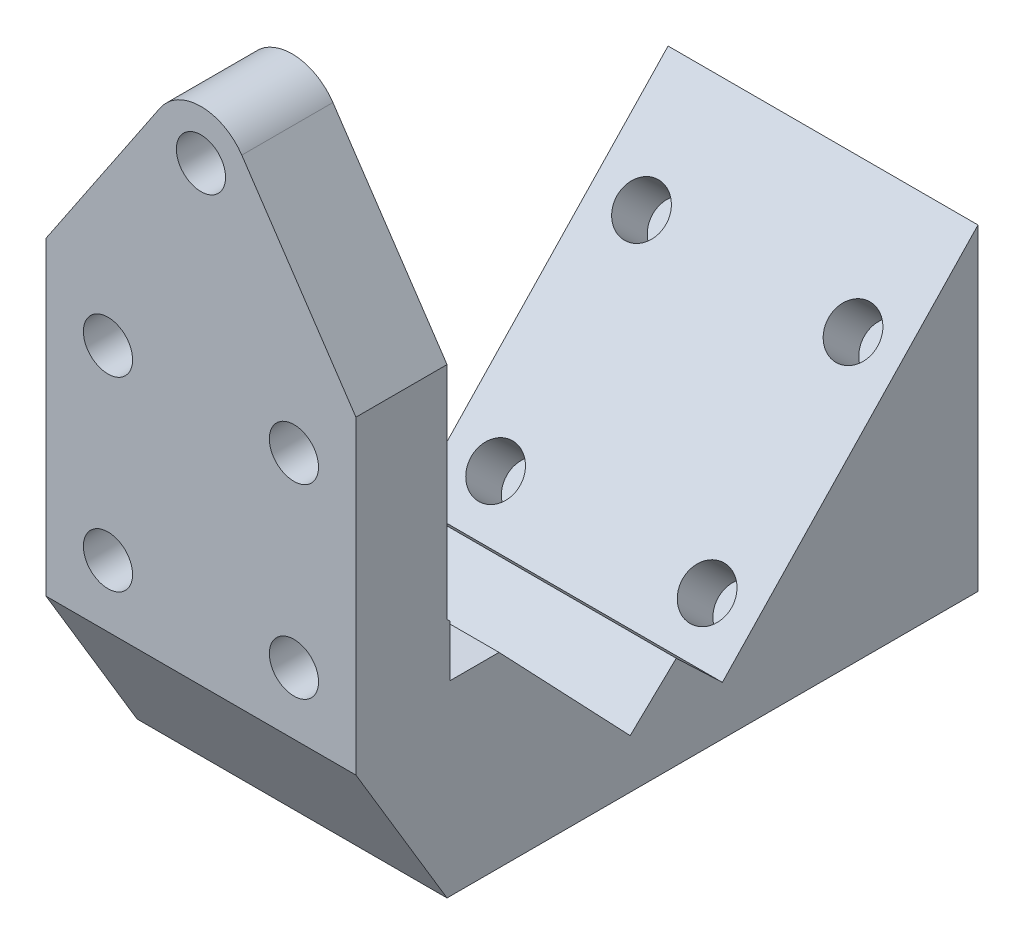
ISO-10303-21;
HEADER;
FILE_DESCRIPTION(('STEP AP214'),'2;1');
FILE_NAME('part.step','',(''),(''),'','','');
FILE_SCHEMA(('AUTOMOTIVE_DESIGN { 1 0 10303 214 1 1 1 1 }'));
ENDSEC;
DATA;
#1=APPLICATION_CONTEXT('core data for automotive mechanical design processes');
#2=APPLICATION_PROTOCOL_DEFINITION('international standard','automotive_design',2000,#1);
#3=PRODUCT_CONTEXT('',#1,'mechanical');
#4=PRODUCT('Part','Part','',(#3));
#5=PRODUCT_RELATED_PRODUCT_CATEGORY('part','',(#4));
#6=PRODUCT_DEFINITION_FORMATION('','',#4);
#7=PRODUCT_DEFINITION_CONTEXT('part definition',#1,'design');
#8=PRODUCT_DEFINITION('design','',#6,#7);
#9=PRODUCT_DEFINITION_SHAPE('','',#8);
#10=(LENGTH_UNIT() NAMED_UNIT(*) SI_UNIT(.MILLI.,.METRE.));
#11=(NAMED_UNIT(*) PLANE_ANGLE_UNIT() SI_UNIT($,.RADIAN.));
#12=(NAMED_UNIT(*) SI_UNIT($,.STERADIAN.) SOLID_ANGLE_UNIT());
#13=UNCERTAINTY_MEASURE_WITH_UNIT(LENGTH_MEASURE(1.E-05),#10,'distance_accuracy_value','');
#14=(GEOMETRIC_REPRESENTATION_CONTEXT(3) GLOBAL_UNCERTAINTY_ASSIGNED_CONTEXT((#13)) GLOBAL_UNIT_ASSIGNED_CONTEXT((#10,
#11,#12)) REPRESENTATION_CONTEXT('',''));
#15=CARTESIAN_POINT('',(0.,0.,0.));
#16=DIRECTION('',(0.,0.,1.));
#17=DIRECTION('',(1.,0.,0.));
#18=AXIS2_PLACEMENT_3D('',#15,#16,#17);
#19=CARTESIAN_POINT('',(-10.,-4.23768792161431,-5.87948086693109));
#20=DIRECTION('',(0.,0.689700373188135,-0.724094879987524));
#21=DIRECTION('',(0.,0.724094879987524,0.689700373188135));
#22=AXIS2_PLACEMENT_3D('',#19,#20,#21);
#23=PLANE('',#22);
#24=DIRECTION('',(1.,0.,0.));
#25=VECTOR('',#24,1.);
#26=CARTESIAN_POINT('',(-10.,-4.42669396080715,-6.05950911926227));
#27=LINE('',#26,#25);
#28=CARTESIAN_POINT('',(6.21181207954061,-4.42669396080715,-6.05950911926227));
#29=VERTEX_POINT('',#28);
#30=CARTESIAN_POINT('',(10.,-4.42669396080715,-6.05950911926227));
#31=VERTEX_POINT('',#30);
#32=EDGE_CURVE('E293',#29,#31,#27,.T.);
#33=ORIENTED_EDGE('',*,*,#32,.F.);
#34=CARTESIAN_POINT('',(6.,-6.,-7.5580831215935));
#35=DIRECTION('',(0.,0.689700373188135,-0.724094879987524));
#36=DIRECTION('',(0.,0.724094879987524,0.689700373188135));
#37=AXIS2_PLACEMENT_3D('',#34,#35,#36);
#38=ELLIPSE('',#37,2.19239224565067,1.5875);
#39=CARTESIAN_POINT('',(5.78818792045939,-4.42669396080715,-6.05950911926227));
#40=VERTEX_POINT('',#39);
#41=EDGE_CURVE('E48',#29,#40,#38,.F.);
#42=ORIENTED_EDGE('',*,*,#41,.T.);
#43=CARTESIAN_POINT('',(-5.7881879204594,-4.42669396080715,-6.05950911926227));
#44=VERTEX_POINT('',#43);
#45=EDGE_CURVE('E292',#44,#40,#27,.T.);
#46=ORIENTED_EDGE('',*,*,#45,.F.);
#47=CARTESIAN_POINT('',(-6.,-6.,-7.5580831215935));
#48=DIRECTION('',(0.,0.689700373188135,-0.724094879987524));
#49=DIRECTION('',(0.,0.724094879987524,0.689700373188135));
#50=AXIS2_PLACEMENT_3D('',#47,#48,#49);
#51=ELLIPSE('',#50,2.19239224565067,1.5875);
#52=CARTESIAN_POINT('',(-6.21181207954059,-4.42669396080715,-6.05950911926227));
#53=VERTEX_POINT('',#52);
#54=EDGE_CURVE('E54',#44,#53,#51,.F.);
#55=ORIENTED_EDGE('',*,*,#54,.T.);
#56=CARTESIAN_POINT('',(-10.,-4.42669396080715,-6.05950911926227));
#57=VERTEX_POINT('',#56);
#58=EDGE_CURVE('E289',#57,#53,#27,.T.);
#59=ORIENTED_EDGE('',*,*,#58,.F.);
#60=DIRECTION('',(0.,0.724094879987524,0.689700373188135));
#61=VECTOR('',#60,1.);
#62=CARTESIAN_POINT('',(-10.,-4.23768792161431,-5.87948086693109));
#63=LINE('',#62,#61);
#64=CARTESIAN_POINT('',(-10.,-4.23768792161431,-5.87948086693109));
#65=VERTEX_POINT('',#64);
#66=EDGE_CURVE('E242',#57,#65,#63,.T.);
#67=ORIENTED_EDGE('',*,*,#66,.T.);
#68=DIRECTION('',(1.,0.,0.));
#69=VECTOR('',#68,1.);
#70=CARTESIAN_POINT('',(-10.,-4.23768792161431,-5.87948086693109));
#71=LINE('',#70,#69);
#72=CARTESIAN_POINT('',(10.,-4.23768792161431,-5.87948086693109));
#73=VERTEX_POINT('',#72);
#74=EDGE_CURVE('E287',#65,#73,#71,.T.);
#75=ORIENTED_EDGE('',*,*,#74,.T.);
#76=DIRECTION('',(0.,0.724094879987524,0.689700373188135));
#77=VECTOR('',#76,1.);
#78=CARTESIAN_POINT('',(10.,-4.23768792161431,-5.87948086693109));
#79=LINE('',#78,#77);
#80=EDGE_CURVE('E281',#31,#73,#79,.T.);
#81=ORIENTED_EDGE('',*,*,#80,.F.);
#82=EDGE_LOOP('',(#33,#42,#46,#55,#59,#67,#75,#81));
#83=FACE_BOUND('',#82,.T.);
#84=ADVANCED_FACE('F33',(#83),#23,.T.);
#85=CARTESIAN_POINT('',(-10.,-10.,0.));
#86=DIRECTION('',(0.,0.,1.));
#87=DIRECTION('',(1.,0.,0.));
#88=AXIS2_PLACEMENT_3D('',#85,#86,#87);
#89=PLANE('',#88);
#90=CARTESIAN_POINT('',(6.,5.99999999999999,0.));
#91=DIRECTION('',(0.,0.,-1.));
#92=DIRECTION('',(-1.,0.,0.));
#93=AXIS2_PLACEMENT_3D('',#90,#91,#92);
#94=CIRCLE('',#93,1.5875);
#95=CARTESIAN_POINT('',(4.4125,5.99999999999999,0.));
#96=VERTEX_POINT('',#95);
#97=EDGE_CURVE('E198',#96,#96,#94,.T.);
#98=ORIENTED_EDGE('',*,*,#97,.T.);
#99=EDGE_LOOP('',(#98));
#100=FACE_BOUND('',#99,.T.);
#101=CARTESIAN_POINT('',(6.,-6.,0.));
#102=DIRECTION('',(0.,0.,-1.));
#103=DIRECTION('',(-1.,0.,0.));
#104=AXIS2_PLACEMENT_3D('',#101,#102,#103);
#105=CIRCLE('',#104,1.5875);
#106=CARTESIAN_POINT('',(4.4125,-6.,0.));
#107=VERTEX_POINT('',#106);
#108=EDGE_CURVE('E201',#107,#107,#105,.T.);
#109=ORIENTED_EDGE('',*,*,#108,.T.);
#110=EDGE_LOOP('',(#109));
#111=FACE_BOUND('',#110,.T.);
#112=CARTESIAN_POINT('',(-6.,-6.,0.));
#113=DIRECTION('',(0.,0.,-1.));
#114=DIRECTION('',(-1.,0.,0.));
#115=AXIS2_PLACEMENT_3D('',#112,#113,#114);
#116=CIRCLE('',#115,1.5875);
#117=CARTESIAN_POINT('',(-7.5875,-6.,0.));
#118=VERTEX_POINT('',#117);
#119=EDGE_CURVE('E181',#118,#118,#116,.T.);
#120=ORIENTED_EDGE('',*,*,#119,.T.);
#121=EDGE_LOOP('',(#120));
#122=FACE_BOUND('',#121,.T.);
#123=CARTESIAN_POINT('',(-6.,5.99999999999999,0.));
#124=DIRECTION('',(0.,0.,-1.));
#125=DIRECTION('',(-1.,0.,0.));
#126=AXIS2_PLACEMENT_3D('',#123,#124,#125);
#127=CIRCLE('',#126,1.5875);
#128=CARTESIAN_POINT('',(-7.5875,5.99999999999999,0.));
#129=VERTEX_POINT('',#128);
#130=EDGE_CURVE('E208',#129,#129,#127,.T.);
#131=ORIENTED_EDGE('',*,*,#130,.T.);
#132=EDGE_LOOP('',(#131));
#133=FACE_BOUND('',#132,.T.);
#134=DIRECTION('',(0.,-1.,0.));
#135=VECTOR('',#134,1.);
#136=CARTESIAN_POINT('',(10.,-10.,0.));
#137=LINE('',#136,#135);
#138=CARTESIAN_POINT('',(10.,10.,0.));
#139=VERTEX_POINT('',#138);
#140=CARTESIAN_POINT('',(10.,-10.,0.));
#141=VERTEX_POINT('',#140);
#142=EDGE_CURVE('E251',#139,#141,#137,.T.);
#143=ORIENTED_EDGE('',*,*,#142,.F.);
#144=DIRECTION('',(0.55760927190137,-0.830103547691265,0.));
#145=VECTOR('',#144,1.);
#146=CARTESIAN_POINT('',(2.63557876391976,20.9632900721285,0.));
#147=LINE('',#146,#145);
#148=CARTESIAN_POINT('',(2.63557876391977,20.9632900721285,0.));
#149=VERTEX_POINT('',#148);
#150=EDGE_CURVE('E191',#149,#139,#147,.T.);
#151=ORIENTED_EDGE('',*,*,#150,.F.);
#152=CARTESIAN_POINT('',(0.,19.1928806338417,0.));
#153=DIRECTION('',(0.,0.,1.));
#154=DIRECTION('',(1.,0.,0.));
#155=AXIS2_PLACEMENT_3D('',#152,#153,#154);
#156=CIRCLE('',#155,3.175);
#157=CARTESIAN_POINT('',(-2.63557876391977,20.9632900721285,0.));
#158=VERTEX_POINT('',#157);
#159=EDGE_CURVE('E159',#158,#149,#156,.F.);
#160=ORIENTED_EDGE('',*,*,#159,.F.);
#161=DIRECTION('',(0.55760927190137,0.830103547691265,0.));
#162=VECTOR('',#161,1.);
#163=CARTESIAN_POINT('',(-2.63557876391977,20.9632900721285,0.));
#164=LINE('',#163,#162);
#165=CARTESIAN_POINT('',(-10.,10.,0.));
#166=VERTEX_POINT('',#165);
#167=EDGE_CURVE('E162',#166,#158,#164,.T.);
#168=ORIENTED_EDGE('',*,*,#167,.F.);
#169=DIRECTION('',(0.,-1.,0.));
#170=VECTOR('',#169,1.);
#171=CARTESIAN_POINT('',(-10.,-10.,0.));
#172=LINE('',#171,#170);
#173=CARTESIAN_POINT('',(-10.,-10.,0.));
#174=VERTEX_POINT('',#173);
#175=EDGE_CURVE('E212',#166,#174,#172,.T.);
#176=ORIENTED_EDGE('',*,*,#175,.T.);
#177=DIRECTION('',(1.,0.,0.));
#178=VECTOR('',#177,1.);
#179=CARTESIAN_POINT('',(-10.,-10.,0.));
#180=LINE('',#179,#178);
#181=EDGE_CURVE('E250',#174,#141,#180,.T.);
#182=ORIENTED_EDGE('',*,*,#181,.T.);
#183=EDGE_LOOP('',(#143,#151,#160,#168,#176,#182));
#184=FACE_BOUND('',#183,.T.);
#185=CARTESIAN_POINT('',(0.,19.1928806338417,0.));
#186=DIRECTION('',(0.,0.,1.));
#187=DIRECTION('',(1.,0.,0.));
#188=AXIS2_PLACEMENT_3D('',#185,#186,#187);
#189=CIRCLE('',#188,1.5875);
#190=CARTESIAN_POINT('',(1.5875,19.1928806338417,0.));
#191=VERTEX_POINT('',#190);
#192=EDGE_CURVE('E178',#191,#191,#189,.F.);
#193=ORIENTED_EDGE('',*,*,#192,.T.);
#194=EDGE_LOOP('',(#193));
#195=FACE_BOUND('',#194,.T.);
#196=ADVANCED_FACE('F35',(#100,#111,#122,#133,#184,#195),#89,.T.);
#197=CARTESIAN_POINT('',(-10.,10.,-5.87948086693109));
#198=DIRECTION('',(0.,0.,-1.));
#199=DIRECTION('',(0.,1.,0.));
#200=AXIS2_PLACEMENT_3D('',#197,#198,#199);
#201=PLANE('',#200);
#202=CARTESIAN_POINT('',(6.,5.99999999999999,-5.87948086693109));
#203=DIRECTION('',(0.,0.,-1.));
#204=DIRECTION('',(0.,1.,0.));
#205=AXIS2_PLACEMENT_3D('',#202,#203,#204);
#206=CIRCLE('',#205,1.5875);
#207=CARTESIAN_POINT('',(6.,7.58749999999999,-5.87948086693109));
#208=VERTEX_POINT('',#207);
#209=EDGE_CURVE('E37',#208,#208,#206,.F.);
#210=ORIENTED_EDGE('',*,*,#209,.T.);
#211=EDGE_LOOP('',(#210));
#212=FACE_BOUND('',#211,.T.);
#213=CARTESIAN_POINT('',(-6.,5.99999999999999,-5.87948086693109));
#214=DIRECTION('',(0.,0.,-1.));
#215=DIRECTION('',(0.,1.,0.));
#216=AXIS2_PLACEMENT_3D('',#213,#214,#215);
#217=CIRCLE('',#216,1.5875);
#218=CARTESIAN_POINT('',(-6.,7.5875,-5.87948086693109));
#219=VERTEX_POINT('',#218);
#220=EDGE_CURVE('E211',#219,#219,#217,.F.);
#221=ORIENTED_EDGE('',*,*,#220,.T.);
#222=EDGE_LOOP('',(#221));
#223=FACE_BOUND('',#222,.T.);
#224=DIRECTION('',(0.,1.,0.));
#225=VECTOR('',#224,1.);
#226=CARTESIAN_POINT('',(10.,10.,-5.87948086693109));
#227=LINE('',#226,#225);
#228=CARTESIAN_POINT('',(10.,10.,-5.87948086693109));
#229=VERTEX_POINT('',#228);
#230=EDGE_CURVE('E284',#73,#229,#227,.T.);
#231=ORIENTED_EDGE('',*,*,#230,.F.);
#232=ORIENTED_EDGE('',*,*,#74,.F.);
#233=DIRECTION('',(0.,1.,0.));
#234=VECTOR('',#233,1.);
#235=CARTESIAN_POINT('',(-10.,10.,-5.87948086693109));
#236=LINE('',#235,#234);
#237=CARTESIAN_POINT('',(-10.,10.,-5.87948086693109));
#238=VERTEX_POINT('',#237);
#239=EDGE_CURVE('E245',#65,#238,#236,.T.);
#240=ORIENTED_EDGE('',*,*,#239,.T.);
#241=DIRECTION('',(0.55760927190137,0.830103547691265,0.));
#242=VECTOR('',#241,1.);
#243=CARTESIAN_POINT('',(-2.63557876391977,20.9632900721285,-5.87948086693109));
#244=LINE('',#243,#242);
#245=CARTESIAN_POINT('',(-2.63557876391977,20.9632900721285,-5.87948086693109));
#246=VERTEX_POINT('',#245);
#247=EDGE_CURVE('E171',#238,#246,#244,.T.);
#248=ORIENTED_EDGE('',*,*,#247,.T.);
#249=CARTESIAN_POINT('',(0.,19.1928806338417,-5.87948086693109));
#250=DIRECTION('',(0.,0.,-1.));
#251=DIRECTION('',(0.,1.,0.));
#252=AXIS2_PLACEMENT_3D('',#249,#250,#251);
#253=CIRCLE('',#252,3.175);
#254=CARTESIAN_POINT('',(2.63557876391977,20.9632900721285,-5.87948086693109));
#255=VERTEX_POINT('',#254);
#256=EDGE_CURVE('E158',#246,#255,#253,.T.);
#257=ORIENTED_EDGE('',*,*,#256,.T.);
#258=DIRECTION('',(0.55760927190137,-0.830103547691265,0.));
#259=VECTOR('',#258,1.);
#260=CARTESIAN_POINT('',(2.63557876391977,20.9632900721285,-5.87948086693109));
#261=LINE('',#260,#259);
#262=EDGE_CURVE('E166',#255,#229,#261,.T.);
#263=ORIENTED_EDGE('',*,*,#262,.T.);
#264=EDGE_LOOP('',(#231,#232,#240,#248,#257,#263));
#265=FACE_BOUND('',#264,.T.);
#266=CARTESIAN_POINT('',(0.,19.1928806338417,-5.87948086693109));
#267=DIRECTION('',(0.,0.,-1.));
#268=DIRECTION('',(0.,1.,0.));
#269=AXIS2_PLACEMENT_3D('',#266,#267,#268);
#270=CIRCLE('',#269,1.5875);
#271=CARTESIAN_POINT('',(0.,20.7803806338417,-5.87948086693109));
#272=VERTEX_POINT('',#271);
#273=EDGE_CURVE('E172',#272,#272,#270,.T.);
#274=ORIENTED_EDGE('',*,*,#273,.F.);
#275=EDGE_LOOP('',(#274));
#276=FACE_BOUND('',#275,.T.);
#277=ADVANCED_FACE('F175',(#212,#223,#265,#276),#201,.T.);
#278=CARTESIAN_POINT('',(-10.,-4.42669396080715,-6.05950911926227));
#279=DIRECTION('',(0.,0.,-1.));
#280=DIRECTION('',(-1.,0.,0.));
#281=AXIS2_PLACEMENT_3D('',#278,#279,#280);
#282=PLANE('',#281);
#283=ORIENTED_EDGE('',*,*,#45,.T.);
#284=CARTESIAN_POINT('',(6.,-6.,-6.05950911926227));
#285=DIRECTION('',(0.,0.,-1.));
#286=DIRECTION('',(-1.,0.,0.));
#287=AXIS2_PLACEMENT_3D('',#284,#285,#286);
#288=CIRCLE('',#287,1.5875);
#289=EDGE_CURVE('E11',#40,#29,#288,.F.);
#290=ORIENTED_EDGE('',*,*,#289,.T.);
#291=ORIENTED_EDGE('',*,*,#32,.T.);
#292=DIRECTION('',(0.,1.,0.));
#293=VECTOR('',#292,1.);
#294=CARTESIAN_POINT('',(10.,-4.42669396080715,-6.05950911926227));
#295=LINE('',#294,#293);
#296=CARTESIAN_POINT('',(10.,-7.76231207838568,-6.05950911926227));
#297=VERTEX_POINT('',#296);
#298=EDGE_CURVE('E278',#297,#31,#295,.T.);
#299=ORIENTED_EDGE('',*,*,#298,.F.);
#300=DIRECTION('',(1.,0.,0.));
#301=VECTOR('',#300,1.);
#302=CARTESIAN_POINT('',(-10.,-7.76231207838568,-6.05950911926227));
#303=LINE('',#302,#301);
#304=CARTESIAN_POINT('',(-10.,-7.76231207838568,-6.05950911926227));
#305=VERTEX_POINT('',#304);
#306=EDGE_CURVE('E294',#305,#297,#303,.T.);
#307=ORIENTED_EDGE('',*,*,#306,.F.);
#308=DIRECTION('',(0.,1.,0.));
#309=VECTOR('',#308,1.);
#310=CARTESIAN_POINT('',(-10.,-4.42669396080715,-6.05950911926227));
#311=LINE('',#310,#309);
#312=EDGE_CURVE('E239',#305,#57,#311,.T.);
#313=ORIENTED_EDGE('',*,*,#312,.T.);
#314=ORIENTED_EDGE('',*,*,#58,.T.);
#315=CARTESIAN_POINT('',(-6.,-6.,-6.05950911926227));
#316=DIRECTION('',(0.,0.,-1.));
#317=DIRECTION('',(-1.,0.,0.));
#318=AXIS2_PLACEMENT_3D('',#315,#316,#317);
#319=CIRCLE('',#318,1.5875);
#320=EDGE_CURVE('E42',#53,#44,#319,.F.);
#321=ORIENTED_EDGE('',*,*,#320,.T.);
#322=EDGE_LOOP('',(#283,#290,#291,#299,#307,#313,#314,#321));
#323=FACE_BOUND('',#322,.T.);
#324=ADVANCED_FACE('F316',(#323),#282,.T.);
#325=CARTESIAN_POINT('',(-10.,-7.76231207838568,-6.05950911926227));
#326=DIRECTION('',(0.,1.,0.));
#327=DIRECTION('',(0.,0.,1.));
#328=AXIS2_PLACEMENT_3D('',#325,#326,#327);
#329=PLANE('',#328);
#330=DIRECTION('',(0.,0.,1.));
#331=VECTOR('',#330,1.);
#332=CARTESIAN_POINT('',(10.,-7.76231207838568,-6.05950911926227));
#333=LINE('',#332,#331);
#334=CARTESIAN_POINT('',(10.,-7.76231207838568,-9.23668537625581));
#335=VERTEX_POINT('',#334);
#336=EDGE_CURVE('E275',#335,#297,#333,.T.);
#337=ORIENTED_EDGE('',*,*,#336,.F.);
#338=DIRECTION('',(1.,0.,0.));
#339=VECTOR('',#338,1.);
#340=CARTESIAN_POINT('',(-10.,-7.76231207838568,-9.23668537625581));
#341=LINE('',#340,#339);
#342=CARTESIAN_POINT('',(-10.,-7.76231207838568,-9.23668537625581));
#343=VERTEX_POINT('',#342);
#344=EDGE_CURVE('E296',#343,#335,#341,.T.);
#345=ORIENTED_EDGE('',*,*,#344,.F.);
#346=DIRECTION('',(0.,0.,1.));
#347=VECTOR('',#346,1.);
#348=CARTESIAN_POINT('',(-10.,-7.76231207838568,-6.05950911926227));
#349=LINE('',#348,#347);
#350=EDGE_CURVE('E236',#343,#305,#349,.T.);
#351=ORIENTED_EDGE('',*,*,#350,.T.);
#352=ORIENTED_EDGE('',*,*,#306,.T.);
#353=EDGE_LOOP('',(#337,#345,#351,#352));
#354=FACE_BOUND('',#353,.T.);
#355=ADVANCED_FACE('F326',(#354),#329,.T.);
#356=CARTESIAN_POINT('',(-10.,-7.76231207838568,-9.23668537625581));
#357=DIRECTION('',(0.,0.689700373188126,-0.724094879987533));
#358=DIRECTION('',(0.,0.724094879987533,0.689700373188126));
#359=AXIS2_PLACEMENT_3D('',#356,#357,#358);
#360=PLANE('',#359);
#361=DIRECTION('',(0.,0.724094879987533,0.689700373188126));
#362=VECTOR('',#361,1.);
#363=CARTESIAN_POINT('',(10.,-7.76231207838568,-9.23668537625581));
#364=LINE('',#363,#362);
#365=CARTESIAN_POINT('',(10.,-16.6450133882954,-17.6974583739448));
#366=VERTEX_POINT('',#365);
#367=EDGE_CURVE('E272',#366,#335,#364,.T.);
#368=ORIENTED_EDGE('',*,*,#367,.F.);
#369=DIRECTION('',(1.,0.,0.));
#370=VECTOR('',#369,1.);
#371=CARTESIAN_POINT('',(-10.,-16.6450133882954,-17.6974583739448));
#372=LINE('',#371,#370);
#373=CARTESIAN_POINT('',(-10.,-16.6450133882954,-17.6974583739448));
#374=VERTEX_POINT('',#373);
#375=EDGE_CURVE('E298',#374,#366,#372,.T.);
#376=ORIENTED_EDGE('',*,*,#375,.F.);
#377=DIRECTION('',(0.,0.724094879987533,0.689700373188126));
#378=VECTOR('',#377,1.);
#379=CARTESIAN_POINT('',(-10.,-7.76231207838568,-9.23668537625581));
#380=LINE('',#379,#378);
#381=EDGE_CURVE('E233',#374,#343,#380,.T.);
#382=ORIENTED_EDGE('',*,*,#381,.T.);
#383=ORIENTED_EDGE('',*,*,#344,.T.);
#384=EDGE_LOOP('',(#368,#376,#382,#383));
#385=FACE_BOUND('',#384,.T.);
#386=ADVANCED_FACE('F364',(#385),#360,.T.);
#387=CARTESIAN_POINT('',(-10.,-16.6450133882954,-17.6974583739448));
#388=DIRECTION('',(0.,0.724094879987534,0.689700373188125));
#389=DIRECTION('',(0.,-0.689700373188125,0.724094879987534));
#390=AXIS2_PLACEMENT_3D('',#387,#388,#389);
#391=PLANE('',#390);
#392=DIRECTION('',(0.,-0.689700373188125,0.724094879987534));
#393=VECTOR('',#392,1.);
#394=CARTESIAN_POINT('',(10.,-16.6450133882954,-17.6974583739448));
#395=LINE('',#394,#393);
#396=CARTESIAN_POINT('',(10.,-13.8103448544922,-20.6734883306936));
#397=VERTEX_POINT('',#396);
#398=EDGE_CURVE('E269',#397,#366,#395,.T.);
#399=ORIENTED_EDGE('',*,*,#398,.F.);
#400=DIRECTION('',(1.,0.,0.));
#401=VECTOR('',#400,1.);
#402=CARTESIAN_POINT('',(-10.,-13.8103448544922,-20.6734883306936));
#403=LINE('',#402,#401);
#404=CARTESIAN_POINT('',(-10.,-13.8103448544922,-20.6734883306936));
#405=VERTEX_POINT('',#404);
#406=EDGE_CURVE('E300',#405,#397,#403,.T.);
#407=ORIENTED_EDGE('',*,*,#406,.F.);
#408=DIRECTION('',(0.,-0.689700373188125,0.724094879987534));
#409=VECTOR('',#408,1.);
#410=CARTESIAN_POINT('',(-10.,-16.6450133882954,-17.6974583739448));
#411=LINE('',#410,#409);
#412=EDGE_CURVE('E230',#405,#374,#411,.T.);
#413=ORIENTED_EDGE('',*,*,#412,.T.);
#414=ORIENTED_EDGE('',*,*,#375,.T.);
#415=EDGE_LOOP('',(#399,#407,#413,#414));
#416=FACE_BOUND('',#415,.T.);
#417=ADVANCED_FACE('F362',(#416),#391,.T.);
#418=CARTESIAN_POINT('',(-10.,-13.8103448544922,-20.6734883306936));
#419=DIRECTION('',(0.,0.724094879987534,-0.689700373188125));
#420=DIRECTION('',(0.,0.689700373188125,0.724094879987534));
#421=AXIS2_PLACEMENT_3D('',#418,#419,#420);
#422=PLANE('',#421);
#423=DIRECTION('',(0.,0.689700373188125,0.724094879987534));
#424=VECTOR('',#423,1.);
#425=CARTESIAN_POINT('',(10.,-13.8103448544922,-20.6734883306936));
#426=LINE('',#425,#424);
#427=CARTESIAN_POINT('',(10.,-16.6450133882954,-23.6495182874424));
#428=VERTEX_POINT('',#427);
#429=EDGE_CURVE('E266',#428,#397,#426,.T.);
#430=ORIENTED_EDGE('',*,*,#429,.F.);
#431=DIRECTION('',(1.,0.,0.));
#432=VECTOR('',#431,1.);
#433=CARTESIAN_POINT('',(-10.,-16.6450133882954,-23.6495182874424));
#434=LINE('',#433,#432);
#435=CARTESIAN_POINT('',(-10.,-16.6450133882954,-23.6495182874424));
#436=VERTEX_POINT('',#435);
#437=EDGE_CURVE('E302',#436,#428,#434,.T.);
#438=ORIENTED_EDGE('',*,*,#437,.F.);
#439=DIRECTION('',(0.,0.689700373188125,0.724094879987534));
#440=VECTOR('',#439,1.);
#441=CARTESIAN_POINT('',(-10.,-13.8103448544922,-20.6734883306936));
#442=LINE('',#441,#440);
#443=EDGE_CURVE('E227',#436,#405,#442,.T.);
#444=ORIENTED_EDGE('',*,*,#443,.T.);
#445=ORIENTED_EDGE('',*,*,#406,.T.);
#446=EDGE_LOOP('',(#430,#438,#444,#445));
#447=FACE_BOUND('',#446,.T.);
#448=ADVANCED_FACE('F358',(#447),#422,.T.);
#449=CARTESIAN_POINT('',(-10.,-16.6450133882954,-23.6495182874424));
#450=DIRECTION('',(0.,0.689700373188125,0.724094879987534));
#451=DIRECTION('',(0.,-0.724094879987534,0.689700373188125));
#452=AXIS2_PLACEMENT_3D('',#449,#450,#451);
#453=PLANE('',#452);
#454=CARTESIAN_POINT('',(6.82499999999999,-14.346012144335,-25.8393169723147));
#455=DIRECTION('',(0.,0.689700373188125,0.724094879987534));
#456=DIRECTION('',(0.,-0.724094879987534,0.689700373188125));
#457=AXIS2_PLACEMENT_3D('',#454,#455,#456);
#458=CIRCLE('',#457,1.5875);
#459=CARTESIAN_POINT('',(6.82499999999999,-15.4955127663152,-24.7444176298785));
#460=VERTEX_POINT('',#459);
#461=EDGE_CURVE('E542',#460,#460,#458,.T.);
#462=ORIENTED_EDGE('',*,*,#461,.F.);
#463=EDGE_LOOP('',(#462));
#464=FACE_BOUND('',#463,.T.);
#465=CARTESIAN_POINT('',(-6.825,-14.346012144335,-25.8393169723147));
#466=DIRECTION('',(0.,0.689700373188125,0.724094879987534));
#467=DIRECTION('',(0.,-0.724094879987534,0.689700373188125));
#468=AXIS2_PLACEMENT_3D('',#465,#466,#467);
#469=CIRCLE('',#468,1.5875);
#470=CARTESIAN_POINT('',(-6.825,-15.4955127663152,-24.7444176298785));
#471=VERTEX_POINT('',#470);
#472=EDGE_CURVE('E551',#471,#471,#469,.T.);
#473=ORIENTED_EDGE('',*,*,#472,.F.);
#474=EDGE_LOOP('',(#473));
#475=FACE_BOUND('',#474,.T.);
#476=CARTESIAN_POINT('',(-6.82499999999999,-4.46211703250518,-35.2537270663326));
#477=DIRECTION('',(0.,0.689700373188125,0.724094879987534));
#478=DIRECTION('',(0.,-0.724094879987534,0.689700373188125));
#479=AXIS2_PLACEMENT_3D('',#476,#477,#478);
#480=CIRCLE('',#479,1.5875);
#481=CARTESIAN_POINT('',(-6.82499999999999,-5.61161765448539,-34.1588277238964));
#482=VERTEX_POINT('',#481);
#483=EDGE_CURVE('E557',#482,#482,#480,.T.);
#484=ORIENTED_EDGE('',*,*,#483,.F.);
#485=EDGE_LOOP('',(#484));
#486=FACE_BOUND('',#485,.T.);
#487=CARTESIAN_POINT('',(6.82499999999999,-4.46211703250518,-35.2537270663326));
#488=DIRECTION('',(0.,0.689700373188125,0.724094879987534));
#489=DIRECTION('',(0.,-0.724094879987534,0.689700373188125));
#490=AXIS2_PLACEMENT_3D('',#487,#488,#489);
#491=CIRCLE('',#490,1.58749999999999);
#492=CARTESIAN_POINT('',(6.82499999999999,-5.61161765448538,-34.1588277238964));
#493=VERTEX_POINT('',#492);
#494=EDGE_CURVE('E185',#493,#493,#491,.T.);
#495=ORIENTED_EDGE('',*,*,#494,.F.);
#496=EDGE_LOOP('',(#495));
#497=FACE_BOUND('',#496,.T.);
#498=DIRECTION('',(0.,-0.724094879987534,0.689700373188125));
#499=VECTOR('',#498,1.);
#500=CARTESIAN_POINT('',(10.,-16.6450133882954,-23.6495182874424));
#501=LINE('',#500,#499);
#502=CARTESIAN_POINT('',(10.,0.671552745258447,-40.1435475296524));
#503=VERTEX_POINT('',#502);
#504=EDGE_CURVE('E263',#503,#428,#501,.T.);
#505=ORIENTED_EDGE('',*,*,#504,.F.);
#506=DIRECTION('',(1.,0.,0.));
#507=VECTOR('',#506,1.);
#508=CARTESIAN_POINT('',(-10.,0.671552745258447,-40.1435475296524));
#509=LINE('',#508,#507);
#510=CARTESIAN_POINT('',(-10.,0.671552745258447,-40.1435475296524));
#511=VERTEX_POINT('',#510);
#512=EDGE_CURVE('E304',#511,#503,#509,.T.);
#513=ORIENTED_EDGE('',*,*,#512,.F.);
#514=DIRECTION('',(0.,-0.724094879987534,0.689700373188125));
#515=VECTOR('',#514,1.);
#516=CARTESIAN_POINT('',(-10.,-16.6450133882954,-23.6495182874424));
#517=LINE('',#516,#515);
#518=EDGE_CURVE('E224',#511,#436,#517,.T.);
#519=ORIENTED_EDGE('',*,*,#518,.T.);
#520=ORIENTED_EDGE('',*,*,#437,.T.);
#521=EDGE_LOOP('',(#505,#513,#519,#520));
#522=FACE_BOUND('',#521,.T.);
#523=ADVANCED_FACE('F354',(#464,#475,#486,#497,#522),#453,.T.);
#524=CARTESIAN_POINT('',(-10.,0.671552745258447,-40.1435475296524));
#525=DIRECTION('',(0.,0.,-1.));
#526=DIRECTION('',(-1.,0.,0.));
#527=AXIS2_PLACEMENT_3D('',#524,#525,#526);
#528=PLANE('',#527);
#529=DIRECTION('',(0.,1.,0.));
#530=VECTOR('',#529,1.);
#531=CARTESIAN_POINT('',(10.,0.671552745258447,-40.1435475296524));
#532=LINE('',#531,#530);
#533=CARTESIAN_POINT('',(10.,-19.8103448544922,-40.1435475296524));
#534=VERTEX_POINT('',#533);
#535=EDGE_CURVE('E260',#534,#503,#532,.T.);
#536=ORIENTED_EDGE('',*,*,#535,.F.);
#537=DIRECTION('',(1.,0.,0.));
#538=VECTOR('',#537,1.);
#539=CARTESIAN_POINT('',(-10.,-19.8103448544922,-40.1435475296524));
#540=LINE('',#539,#538);
#541=CARTESIAN_POINT('',(-10.,-19.8103448544922,-40.1435475296524));
#542=VERTEX_POINT('',#541);
#543=EDGE_CURVE('E306',#542,#534,#540,.T.);
#544=ORIENTED_EDGE('',*,*,#543,.F.);
#545=DIRECTION('',(0.,1.,0.));
#546=VECTOR('',#545,1.);
#547=CARTESIAN_POINT('',(-10.,0.671552745258447,-40.1435475296524));
#548=LINE('',#547,#546);
#549=EDGE_CURVE('E221',#542,#511,#548,.T.);
#550=ORIENTED_EDGE('',*,*,#549,.T.);
#551=ORIENTED_EDGE('',*,*,#512,.T.);
#552=EDGE_LOOP('',(#536,#544,#550,#551));
#553=FACE_BOUND('',#552,.T.);
#554=ADVANCED_FACE('F350',(#553),#528,.T.);
#555=CARTESIAN_POINT('',(-10.,-19.8103448544922,-40.1435475296524));
#556=DIRECTION('',(0.,-1.,0.));
#557=DIRECTION('',(0.,0.,-1.));
#558=AXIS2_PLACEMENT_3D('',#555,#556,#557);
#559=PLANE('',#558);
#560=DIRECTION('',(0.,0.,-1.));
#561=VECTOR('',#560,1.);
#562=CARTESIAN_POINT('',(10.,-19.8103448544922,-40.1435475296524));
#563=LINE('',#562,#561);
#564=CARTESIAN_POINT('',(10.,-19.8103448544922,-5.87948086693109));
#565=VERTEX_POINT('',#564);
#566=EDGE_CURVE('E257',#565,#534,#563,.T.);
#567=ORIENTED_EDGE('',*,*,#566,.F.);
#568=DIRECTION('',(1.,0.,0.));
#569=VECTOR('',#568,1.);
#570=CARTESIAN_POINT('',(-10.,-19.8103448544922,-5.87948086693109));
#571=LINE('',#570,#569);
#572=CARTESIAN_POINT('',(-10.,-19.8103448544922,-5.87948086693109));
#573=VERTEX_POINT('',#572);
#574=EDGE_CURVE('E308',#573,#565,#571,.T.);
#575=ORIENTED_EDGE('',*,*,#574,.F.);
#576=DIRECTION('',(0.,0.,-1.));
#577=VECTOR('',#576,1.);
#578=CARTESIAN_POINT('',(-10.,-19.8103448544922,-40.1435475296524));
#579=LINE('',#578,#577);
#580=EDGE_CURVE('E218',#573,#542,#579,.T.);
#581=ORIENTED_EDGE('',*,*,#580,.T.);
#582=ORIENTED_EDGE('',*,*,#543,.T.);
#583=EDGE_LOOP('',(#567,#575,#581,#582));
#584=FACE_BOUND('',#583,.T.);
#585=ADVANCED_FACE('F346',(#584),#559,.T.);
#586=CARTESIAN_POINT('',(-10.,-19.8103448544922,-5.87948086693109));
#587=DIRECTION('',(0.,-0.514063277243234,0.857752264345566));
#588=DIRECTION('',(0.,-0.857752264345566,-0.514063277243234));
#589=AXIS2_PLACEMENT_3D('',#586,#587,#588);
#590=PLANE('',#589);
#591=DIRECTION('',(0.,-0.857752264345566,-0.514063277243234));
#592=VECTOR('',#591,1.);
#593=CARTESIAN_POINT('',(10.,-19.8103448544922,-5.87948086693109));
#594=LINE('',#593,#592);
#595=EDGE_CURVE('E254',#141,#565,#594,.T.);
#596=ORIENTED_EDGE('',*,*,#595,.F.);
#597=ORIENTED_EDGE('',*,*,#181,.F.);
#598=DIRECTION('',(0.,-0.857752264345566,-0.514063277243234));
#599=VECTOR('',#598,1.);
#600=CARTESIAN_POINT('',(-10.,-19.8103448544922,-5.87948086693109));
#601=LINE('',#600,#599);
#602=EDGE_CURVE('E215',#174,#573,#601,.T.);
#603=ORIENTED_EDGE('',*,*,#602,.T.);
#604=ORIENTED_EDGE('',*,*,#574,.T.);
#605=EDGE_LOOP('',(#596,#597,#603,#604));
#606=FACE_BOUND('',#605,.T.);
#607=ADVANCED_FACE('F342',(#606),#590,.T.);
#608=CARTESIAN_POINT('',(-10.,0.,0.));
#609=DIRECTION('',(-1.,0.,0.));
#610=DIRECTION('',(0.,0.,1.));
#611=AXIS2_PLACEMENT_3D('',#608,#609,#610);
#612=PLANE('',#611);
#613=ORIENTED_EDGE('',*,*,#175,.F.);
#614=DIRECTION('',(0.,0.,1.));
#615=VECTOR('',#614,1.);
#616=CARTESIAN_POINT('',(-10.,10.,0.));
#617=LINE('',#616,#615);
#618=EDGE_CURVE('E247',#238,#166,#617,.T.);
#619=ORIENTED_EDGE('',*,*,#618,.F.);
#620=ORIENTED_EDGE('',*,*,#239,.F.);
#621=ORIENTED_EDGE('',*,*,#66,.F.);
#622=ORIENTED_EDGE('',*,*,#312,.F.);
#623=ORIENTED_EDGE('',*,*,#350,.F.);
#624=ORIENTED_EDGE('',*,*,#381,.F.);
#625=ORIENTED_EDGE('',*,*,#412,.F.);
#626=ORIENTED_EDGE('',*,*,#443,.F.);
#627=ORIENTED_EDGE('',*,*,#518,.F.);
#628=ORIENTED_EDGE('',*,*,#549,.F.);
#629=ORIENTED_EDGE('',*,*,#580,.F.);
#630=ORIENTED_EDGE('',*,*,#602,.F.);
#631=EDGE_LOOP('',(#613,#619,#620,#621,#622,#623,#624,#625,#626,#627,#628,#629,#630));
#632=FACE_BOUND('',#631,.T.);
#633=ADVANCED_FACE('F331',(#632),#612,.T.);
#634=CARTESIAN_POINT('',(10.,0.,0.));
#635=DIRECTION('',(-1.,0.,0.));
#636=DIRECTION('',(0.,0.,1.));
#637=AXIS2_PLACEMENT_3D('',#634,#635,#636);
#638=PLANE('',#637);
#639=ORIENTED_EDGE('',*,*,#142,.T.);
#640=ORIENTED_EDGE('',*,*,#595,.T.);
#641=ORIENTED_EDGE('',*,*,#566,.T.);
#642=ORIENTED_EDGE('',*,*,#535,.T.);
#643=ORIENTED_EDGE('',*,*,#504,.T.);
#644=ORIENTED_EDGE('',*,*,#429,.T.);
#645=ORIENTED_EDGE('',*,*,#398,.T.);
#646=ORIENTED_EDGE('',*,*,#367,.T.);
#647=ORIENTED_EDGE('',*,*,#336,.T.);
#648=ORIENTED_EDGE('',*,*,#298,.T.);
#649=ORIENTED_EDGE('',*,*,#80,.T.);
#650=ORIENTED_EDGE('',*,*,#230,.T.);
#651=DIRECTION('',(0.,0.,1.));
#652=VECTOR('',#651,1.);
#653=CARTESIAN_POINT('',(10.,10.,0.));
#654=LINE('',#653,#652);
#655=EDGE_CURVE('E168',#229,#139,#654,.T.);
#656=ORIENTED_EDGE('',*,*,#655,.T.);
#657=EDGE_LOOP('',(#639,#640,#641,#642,#643,#644,#645,#646,#647,#648,#649,#650,#656));
#658=FACE_BOUND('',#657,.T.);
#659=ADVANCED_FACE('F322',(#658),#638,.F.);
#660=CARTESIAN_POINT('',(-6.,5.99999999999999,-10.5496371797968));
#661=DIRECTION('',(0.,0.,1.));
#662=DIRECTION('',(1.,0.,0.));
#663=AXIS2_PLACEMENT_3D('',#660,#661,#662);
#664=CYLINDRICAL_SURFACE('',#663,1.5875);
#665=ORIENTED_EDGE('',*,*,#220,.F.);
#666=EDGE_LOOP('',(#665));
#667=FACE_BOUND('',#666,.T.);
#668=ORIENTED_EDGE('',*,*,#130,.F.);
#669=EDGE_LOOP('',(#668));
#670=FACE_BOUND('',#669,.T.);
#671=ADVANCED_FACE('F412',(#667,#670),#664,.F.);
#672=CARTESIAN_POINT('',(-6.,-6.,-10.5496371797968));
#673=DIRECTION('',(0.,0.,1.));
#674=DIRECTION('',(1.,0.,0.));
#675=AXIS2_PLACEMENT_3D('',#672,#673,#674);
#676=CYLINDRICAL_SURFACE('',#675,1.5875);
#677=ORIENTED_EDGE('',*,*,#119,.F.);
#678=EDGE_LOOP('',(#677));
#679=FACE_BOUND('',#678,.T.);
#680=ORIENTED_EDGE('',*,*,#320,.F.);
#681=ORIENTED_EDGE('',*,*,#54,.F.);
#682=EDGE_LOOP('',(#680,#681));
#683=FACE_BOUND('',#682,.T.);
#684=ADVANCED_FACE('F416',(#679,#683),#676,.F.);
#685=CARTESIAN_POINT('',(6.,-6.,-10.5496371797968));
#686=DIRECTION('',(0.,0.,1.));
#687=DIRECTION('',(1.,0.,0.));
#688=AXIS2_PLACEMENT_3D('',#685,#686,#687);
#689=CYLINDRICAL_SURFACE('',#688,1.5875);
#690=ORIENTED_EDGE('',*,*,#108,.F.);
#691=EDGE_LOOP('',(#690));
#692=FACE_BOUND('',#691,.T.);
#693=ORIENTED_EDGE('',*,*,#289,.F.);
#694=ORIENTED_EDGE('',*,*,#41,.F.);
#695=EDGE_LOOP('',(#693,#694));
#696=FACE_BOUND('',#695,.T.);
#697=ADVANCED_FACE('F420',(#692,#696),#689,.F.);
#698=CARTESIAN_POINT('',(6.,5.99999999999999,-10.5496371797968));
#699=DIRECTION('',(0.,0.,1.));
#700=DIRECTION('',(1.,0.,0.));
#701=AXIS2_PLACEMENT_3D('',#698,#699,#700);
#702=CYLINDRICAL_SURFACE('',#701,1.5875);
#703=ORIENTED_EDGE('',*,*,#209,.F.);
#704=EDGE_LOOP('',(#703));
#705=FACE_BOUND('',#704,.T.);
#706=ORIENTED_EDGE('',*,*,#97,.F.);
#707=EDGE_LOOP('',(#706));
#708=FACE_BOUND('',#707,.T.);
#709=ADVANCED_FACE('F424',(#705,#708),#702,.F.);
#710=CARTESIAN_POINT('',(2.63557876391977,20.9632900721285,23.5151966050245));
#711=DIRECTION('',(0.830103547691265,0.55760927190137,0.));
#712=DIRECTION('',(-0.55760927190137,0.830103547691265,0.));
#713=AXIS2_PLACEMENT_3D('',#710,#711,#712);
#714=PLANE('',#713);
#715=DIRECTION('',(0.,0.,-1.));
#716=VECTOR('',#715,1.);
#717=CARTESIAN_POINT('',(2.63557876391977,20.9632900721285,23.5151966050245));
#718=LINE('',#717,#716);
#719=EDGE_CURVE('E153',#149,#255,#718,.T.);
#720=ORIENTED_EDGE('',*,*,#719,.F.);
#721=ORIENTED_EDGE('',*,*,#150,.T.);
#722=ORIENTED_EDGE('',*,*,#655,.F.);
#723=ORIENTED_EDGE('',*,*,#262,.F.);
#724=EDGE_LOOP('',(#720,#721,#722,#723));
#725=FACE_BOUND('',#724,.T.);
#726=ADVANCED_FACE('F167',(#725),#714,.T.);
#727=CARTESIAN_POINT('',(0.,19.1928806338417,23.5151966050245));
#728=DIRECTION('',(0.,0.,-1.));
#729=DIRECTION('',(0.,1.,0.));
#730=AXIS2_PLACEMENT_3D('',#727,#728,#729);
#731=CYLINDRICAL_SURFACE('',#730,3.175);
#732=DIRECTION('',(0.,0.,-1.));
#733=VECTOR('',#732,1.);
#734=CARTESIAN_POINT('',(-2.63557876391977,20.9632900721285,23.5151966050245));
#735=LINE('',#734,#733);
#736=EDGE_CURVE('E189',#158,#246,#735,.T.);
#737=ORIENTED_EDGE('',*,*,#736,.F.);
#738=ORIENTED_EDGE('',*,*,#159,.T.);
#739=ORIENTED_EDGE('',*,*,#719,.T.);
#740=ORIENTED_EDGE('',*,*,#256,.F.);
#741=EDGE_LOOP('',(#737,#738,#739,#740));
#742=FACE_BOUND('',#741,.T.);
#743=ADVANCED_FACE('F156',(#742),#731,.T.);
#744=CARTESIAN_POINT('',(-2.63557876391977,20.9632900721285,23.5151966050245));
#745=DIRECTION('',(-0.830103547691265,0.55760927190137,0.));
#746=DIRECTION('',(-0.55760927190137,-0.830103547691265,0.));
#747=AXIS2_PLACEMENT_3D('',#744,#745,#746);
#748=PLANE('',#747);
#749=ORIENTED_EDGE('',*,*,#618,.T.);
#750=ORIENTED_EDGE('',*,*,#167,.T.);
#751=ORIENTED_EDGE('',*,*,#736,.T.);
#752=ORIENTED_EDGE('',*,*,#247,.F.);
#753=EDGE_LOOP('',(#749,#750,#751,#752));
#754=FACE_BOUND('',#753,.T.);
#755=ADVANCED_FACE('F366',(#754),#748,.T.);
#756=CARTESIAN_POINT('',(0.,19.1928806338417,23.5151966050245));
#757=DIRECTION('',(0.,0.,-1.));
#758=DIRECTION('',(0.,1.,0.));
#759=AXIS2_PLACEMENT_3D('',#756,#757,#758);
#760=CYLINDRICAL_SURFACE('',#759,1.5875);
#761=ORIENTED_EDGE('',*,*,#273,.T.);
#762=EDGE_LOOP('',(#761));
#763=FACE_BOUND('',#762,.T.);
#764=ORIENTED_EDGE('',*,*,#192,.F.);
#765=EDGE_LOOP('',(#764));
#766=FACE_BOUND('',#765,.T.);
#767=ADVANCED_FACE('F368',(#763,#766),#760,.F.);
#768=CARTESIAN_POINT('',(6.82499999999999,-6.65191571737748,-37.552728310293));
#769=DIRECTION('',(0.,0.689700373188125,0.724094879987534));
#770=DIRECTION('',(0.,-0.724094879987534,0.689700373188125));
#771=AXIS2_PLACEMENT_3D('',#768,#769,#770);
#772=CYLINDRICAL_SURFACE('',#771,1.58749999999999);
#773=CARTESIAN_POINT('',(6.82499999999999,-6.65191571737748,-37.552728310293));
#774=DIRECTION('',(0.,0.689700373188125,0.724094879987534));
#775=DIRECTION('',(0.,-0.724094879987534,0.689700373188125));
#776=AXIS2_PLACEMENT_3D('',#773,#774,#775);
#777=CIRCLE('',#776,1.58749999999999);
#778=CARTESIAN_POINT('',(6.82499999999999,-7.80141633935768,-36.4578289678568));
#779=VERTEX_POINT('',#778);
#780=EDGE_CURVE('E193',#779,#779,#777,.T.);
#781=ORIENTED_EDGE('',*,*,#780,.F.);
#782=EDGE_LOOP('',(#781));
#783=FACE_BOUND('',#782,.T.);
#784=ORIENTED_EDGE('',*,*,#494,.T.);
#785=EDGE_LOOP('',(#784));
#786=FACE_BOUND('',#785,.T.);
#787=ADVANCED_FACE('F374',(#783,#786),#772,.F.);
#788=CARTESIAN_POINT('',(6.82499999999999,-6.65191571737748,-37.552728310293));
#789=DIRECTION('',(0.,0.689700373188125,0.724094879987534));
#790=DIRECTION('',(0.,-0.724094879987534,0.689700373188125));
#791=AXIS2_PLACEMENT_3D('',#788,#789,#790);
#792=PLANE('',#791);
#793=ORIENTED_EDGE('',*,*,#780,.T.);
#794=EDGE_LOOP('',(#793));
#795=FACE_BOUND('',#794,.T.);
#796=ADVANCED_FACE('F466',(#795),#792,.T.);
#797=CARTESIAN_POINT('',(-6.82499999999999,-6.65191571737747,-37.552728310293));
#798=DIRECTION('',(0.,0.689700373188125,0.724094879987534));
#799=DIRECTION('',(0.,-0.724094879987534,0.689700373188125));
#800=AXIS2_PLACEMENT_3D('',#797,#798,#799);
#801=CYLINDRICAL_SURFACE('',#800,1.5875);
#802=CARTESIAN_POINT('',(-6.82499999999999,-6.65191571737747,-37.552728310293));
#803=DIRECTION('',(0.,0.689700373188125,0.724094879987534));
#804=DIRECTION('',(0.,-0.724094879987534,0.689700373188125));
#805=AXIS2_PLACEMENT_3D('',#802,#803,#804);
#806=CIRCLE('',#805,1.5875);
#807=CARTESIAN_POINT('',(-6.82499999999999,-7.80141633935769,-36.4578289678568));
#808=VERTEX_POINT('',#807);
#809=EDGE_CURVE('E554',#808,#808,#806,.T.);
#810=ORIENTED_EDGE('',*,*,#809,.F.);
#811=EDGE_LOOP('',(#810));
#812=FACE_BOUND('',#811,.T.);
#813=ORIENTED_EDGE('',*,*,#483,.T.);
#814=EDGE_LOOP('',(#813));
#815=FACE_BOUND('',#814,.T.);
#816=ADVANCED_FACE('F475',(#812,#815),#801,.F.);
#817=CARTESIAN_POINT('',(-6.82499999999999,-6.65191571737747,-37.552728310293));
#818=DIRECTION('',(0.,0.689700373188125,0.724094879987534));
#819=DIRECTION('',(0.,-0.724094879987534,0.689700373188125));
#820=AXIS2_PLACEMENT_3D('',#817,#818,#819);
#821=PLANE('',#820);
#822=ORIENTED_EDGE('',*,*,#809,.T.);
#823=EDGE_LOOP('',(#822));
#824=FACE_BOUND('',#823,.T.);
#825=ADVANCED_FACE('F485',(#824),#821,.T.);
#826=CARTESIAN_POINT('',(-6.825,-16.5358108292073,-28.1383182162751));
#827=DIRECTION('',(0.,0.689700373188125,0.724094879987534));
#828=DIRECTION('',(0.,-0.724094879987534,0.689700373188125));
#829=AXIS2_PLACEMENT_3D('',#826,#827,#828);
#830=CYLINDRICAL_SURFACE('',#829,1.5875);
#831=CARTESIAN_POINT('',(-6.825,-16.5358108292073,-28.1383182162751));
#832=DIRECTION('',(0.,0.689700373188125,0.724094879987534));
#833=DIRECTION('',(0.,-0.724094879987534,0.689700373188125));
#834=AXIS2_PLACEMENT_3D('',#831,#832,#833);
#835=CIRCLE('',#834,1.5875);
#836=CARTESIAN_POINT('',(-6.825,-17.6853114511875,-27.0434188738389));
#837=VERTEX_POINT('',#836);
#838=EDGE_CURVE('E546',#837,#837,#835,.T.);
#839=ORIENTED_EDGE('',*,*,#838,.F.);
#840=EDGE_LOOP('',(#839));
#841=FACE_BOUND('',#840,.T.);
#842=ORIENTED_EDGE('',*,*,#472,.T.);
#843=EDGE_LOOP('',(#842));
#844=FACE_BOUND('',#843,.T.);
#845=ADVANCED_FACE('F495',(#841,#844),#830,.F.);
#846=CARTESIAN_POINT('',(-6.825,-16.5358108292073,-28.1383182162751));
#847=DIRECTION('',(0.,0.689700373188125,0.724094879987534));
#848=DIRECTION('',(0.,-0.724094879987534,0.689700373188125));
#849=AXIS2_PLACEMENT_3D('',#846,#847,#848);
#850=PLANE('',#849);
#851=ORIENTED_EDGE('',*,*,#838,.T.);
#852=EDGE_LOOP('',(#851));
#853=FACE_BOUND('',#852,.T.);
#854=ADVANCED_FACE('F505',(#853),#850,.T.);
#855=CARTESIAN_POINT('',(6.82499999999999,-16.5358108292073,-28.1383182162751));
#856=DIRECTION('',(0.,0.689700373188125,0.724094879987534));
#857=DIRECTION('',(0.,-0.724094879987534,0.689700373188125));
#858=AXIS2_PLACEMENT_3D('',#855,#856,#857);
#859=CYLINDRICAL_SURFACE('',#858,1.5875);
#860=CARTESIAN_POINT('',(6.82499999999999,-16.5358108292073,-28.1383182162751));
#861=DIRECTION('',(0.,0.689700373188125,0.724094879987534));
#862=DIRECTION('',(0.,-0.724094879987534,0.689700373188125));
#863=AXIS2_PLACEMENT_3D('',#860,#861,#862);
#864=CIRCLE('',#863,1.5875);
#865=CARTESIAN_POINT('',(6.82499999999999,-17.6853114511875,-27.0434188738389));
#866=VERTEX_POINT('',#865);
#867=EDGE_CURVE('E541',#866,#866,#864,.T.);
#868=ORIENTED_EDGE('',*,*,#867,.F.);
#869=EDGE_LOOP('',(#868));
#870=FACE_BOUND('',#869,.T.);
#871=ORIENTED_EDGE('',*,*,#461,.T.);
#872=EDGE_LOOP('',(#871));
#873=FACE_BOUND('',#872,.T.);
#874=ADVANCED_FACE('F515',(#870,#873),#859,.F.);
#875=CARTESIAN_POINT('',(6.82499999999999,-16.5358108292073,-28.1383182162751));
#876=DIRECTION('',(0.,0.689700373188125,0.724094879987534));
#877=DIRECTION('',(0.,-0.724094879987534,0.689700373188125));
#878=AXIS2_PLACEMENT_3D('',#875,#876,#877);
#879=PLANE('',#878);
#880=ORIENTED_EDGE('',*,*,#867,.T.);
#881=EDGE_LOOP('',(#880));
#882=FACE_BOUND('',#881,.T.);
#883=ADVANCED_FACE('F525',(#882),#879,.T.);
#884=CLOSED_SHELL('',(#84,#196,#277,#324,#355,#386,#417,#448,#523,#554,#585,#607,#633,#659,#671,
#684,#697,#709,#726,#743,#755,#767,#787,#796,#816,#825,#845,#854,#874,#883));
#885=MANIFOLD_SOLID_BREP('B2',#884);
#886=ADVANCED_BREP_SHAPE_REPRESENTATION('',(#18,#885),#14);
#887=SHAPE_DEFINITION_REPRESENTATION(#9,#886);
ENDSEC;
END-ISO-10303-21;
